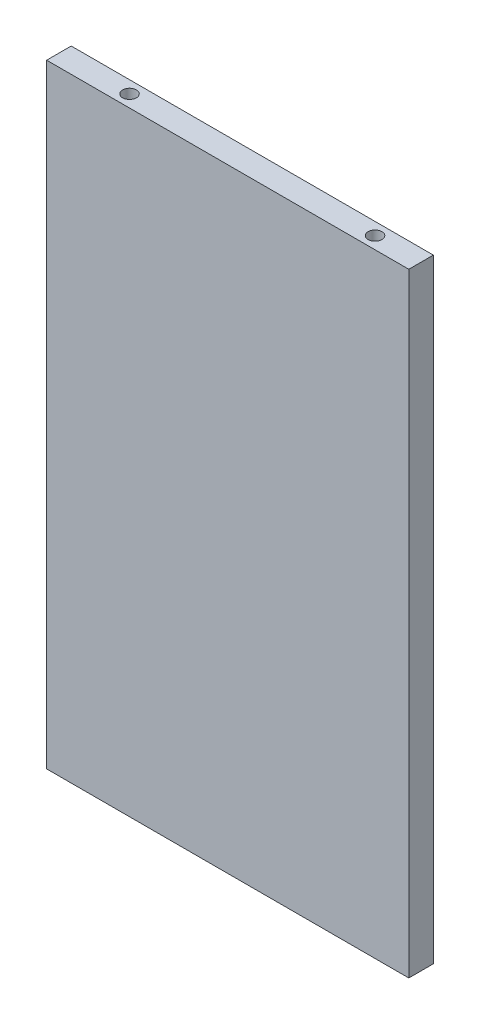
ISO-10303-21;
HEADER;
FILE_DESCRIPTION(('STEP AP214'),'2;1');
FILE_NAME('part.step','',(''),(''),'','','');
FILE_SCHEMA(('AUTOMOTIVE_DESIGN { 1 0 10303 214 1 1 1 1 }'));
ENDSEC;
DATA;
#1=APPLICATION_CONTEXT('core data for automotive mechanical design processes');
#2=APPLICATION_PROTOCOL_DEFINITION('international standard','automotive_design',2000,#1);
#3=PRODUCT_CONTEXT('',#1,'mechanical');
#4=PRODUCT('Part','Part','',(#3));
#5=PRODUCT_RELATED_PRODUCT_CATEGORY('part','',(#4));
#6=PRODUCT_DEFINITION_FORMATION('','',#4);
#7=PRODUCT_DEFINITION_CONTEXT('part definition',#1,'design');
#8=PRODUCT_DEFINITION('design','',#6,#7);
#9=PRODUCT_DEFINITION_SHAPE('','',#8);
#10=(LENGTH_UNIT() NAMED_UNIT(*) SI_UNIT(.MILLI.,.METRE.));
#11=(NAMED_UNIT(*) PLANE_ANGLE_UNIT() SI_UNIT($,.RADIAN.));
#12=(NAMED_UNIT(*) SI_UNIT($,.STERADIAN.) SOLID_ANGLE_UNIT());
#13=UNCERTAINTY_MEASURE_WITH_UNIT(LENGTH_MEASURE(1.E-05),#10,'distance_accuracy_value','');
#14=(GEOMETRIC_REPRESENTATION_CONTEXT(3) GLOBAL_UNCERTAINTY_ASSIGNED_CONTEXT((#13)) GLOBAL_UNIT_ASSIGNED_CONTEXT((#10,
#11,#12)) REPRESENTATION_CONTEXT('',''));
#15=CARTESIAN_POINT('',(0.,0.,0.));
#16=DIRECTION('',(0.,0.,1.));
#17=DIRECTION('',(1.,0.,0.));
#18=AXIS2_PLACEMENT_3D('',#15,#16,#17);
#19=CARTESIAN_POINT('',(0.,200.,0.));
#20=DIRECTION('',(1.,0.,0.));
#21=DIRECTION('',(0.,0.,-1.));
#22=AXIS2_PLACEMENT_3D('',#19,#20,#21);
#23=PLANE('',#22);
#24=DIRECTION('',(0.,0.,1.));
#25=VECTOR('',#24,1.);
#26=CARTESIAN_POINT('',(0.,0.,0.));
#27=LINE('',#26,#25);
#28=CARTESIAN_POINT('',(0.,0.,-8.));
#29=VERTEX_POINT('',#28);
#30=CARTESIAN_POINT('',(0.,0.,0.));
#31=VERTEX_POINT('',#30);
#32=EDGE_CURVE('E123',#29,#31,#27,.T.);
#33=ORIENTED_EDGE('',*,*,#32,.T.);
#34=DIRECTION('',(0.,-1.,0.));
#35=VECTOR('',#34,1.);
#36=CARTESIAN_POINT('',(0.,200.,0.));
#37=LINE('',#36,#35);
#38=CARTESIAN_POINT('',(0.,200.,0.));
#39=VERTEX_POINT('',#38);
#40=EDGE_CURVE('E11',#39,#31,#37,.T.);
#41=ORIENTED_EDGE('',*,*,#40,.F.);
#42=DIRECTION('',(0.,0.,1.));
#43=VECTOR('',#42,1.);
#44=CARTESIAN_POINT('',(0.,200.,0.));
#45=LINE('',#44,#43);
#46=CARTESIAN_POINT('',(0.,200.,-8.));
#47=VERTEX_POINT('',#46);
#48=EDGE_CURVE('E124',#47,#39,#45,.T.);
#49=ORIENTED_EDGE('',*,*,#48,.F.);
#50=DIRECTION('',(0.,-1.,0.));
#51=VECTOR('',#50,1.);
#52=CARTESIAN_POINT('',(0.,200.,-8.));
#53=LINE('',#52,#51);
#54=EDGE_CURVE('E130',#47,#29,#53,.T.);
#55=ORIENTED_EDGE('',*,*,#54,.T.);
#56=EDGE_LOOP('',(#33,#41,#49,#55));
#57=FACE_BOUND('',#56,.T.);
#58=ADVANCED_FACE('F31',(#57),#23,.F.);
#59=CARTESIAN_POINT('',(0.,200.,0.));
#60=DIRECTION('',(0.,0.,-1.));
#61=DIRECTION('',(-1.,0.,0.));
#62=AXIS2_PLACEMENT_3D('',#59,#60,#61);
#63=PLANE('',#62);
#64=DIRECTION('',(1.,0.,0.));
#65=VECTOR('',#64,1.);
#66=CARTESIAN_POINT('',(0.,0.,0.));
#67=LINE('',#66,#65);
#68=CARTESIAN_POINT('',(118.,0.,0.));
#69=VERTEX_POINT('',#68);
#70=EDGE_CURVE('E133',#31,#69,#67,.T.);
#71=ORIENTED_EDGE('',*,*,#70,.T.);
#72=DIRECTION('',(0.,-1.,0.));
#73=VECTOR('',#72,1.);
#74=CARTESIAN_POINT('',(118.,200.,0.));
#75=LINE('',#74,#73);
#76=CARTESIAN_POINT('',(118.,200.,0.));
#77=VERTEX_POINT('',#76);
#78=EDGE_CURVE('E39',#77,#69,#75,.T.);
#79=ORIENTED_EDGE('',*,*,#78,.F.);
#80=DIRECTION('',(1.,0.,0.));
#81=VECTOR('',#80,1.);
#82=CARTESIAN_POINT('',(0.,200.,0.));
#83=LINE('',#82,#81);
#84=EDGE_CURVE('E78',#39,#77,#83,.T.);
#85=ORIENTED_EDGE('',*,*,#84,.F.);
#86=ORIENTED_EDGE('',*,*,#40,.T.);
#87=EDGE_LOOP('',(#71,#79,#85,#86));
#88=FACE_BOUND('',#87,.T.);
#89=ADVANCED_FACE('F157',(#88),#63,.F.);
#90=CARTESIAN_POINT('',(118.,200.,0.));
#91=DIRECTION('',(-1.,0.,0.));
#92=DIRECTION('',(0.,0.,1.));
#93=AXIS2_PLACEMENT_3D('',#90,#91,#92);
#94=PLANE('',#93);
#95=DIRECTION('',(0.,0.,-1.));
#96=VECTOR('',#95,1.);
#97=CARTESIAN_POINT('',(118.,0.,0.));
#98=LINE('',#97,#96);
#99=CARTESIAN_POINT('',(118.,0.,-8.));
#100=VERTEX_POINT('',#99);
#101=EDGE_CURVE('E65',#69,#100,#98,.T.);
#102=ORIENTED_EDGE('',*,*,#101,.T.);
#103=DIRECTION('',(0.,-1.,0.));
#104=VECTOR('',#103,1.);
#105=CARTESIAN_POINT('',(118.,200.,-8.));
#106=LINE('',#105,#104);
#107=CARTESIAN_POINT('',(118.,200.,-8.));
#108=VERTEX_POINT('',#107);
#109=EDGE_CURVE('E138',#108,#100,#106,.T.);
#110=ORIENTED_EDGE('',*,*,#109,.F.);
#111=DIRECTION('',(0.,0.,-1.));
#112=VECTOR('',#111,1.);
#113=CARTESIAN_POINT('',(118.,200.,0.));
#114=LINE('',#113,#112);
#115=EDGE_CURVE('E127',#77,#108,#114,.T.);
#116=ORIENTED_EDGE('',*,*,#115,.F.);
#117=ORIENTED_EDGE('',*,*,#78,.T.);
#118=EDGE_LOOP('',(#102,#110,#116,#117));
#119=FACE_BOUND('',#118,.T.);
#120=ADVANCED_FACE('F140',(#119),#94,.F.);
#121=CARTESIAN_POINT('',(0.,200.,-8.));
#122=DIRECTION('',(0.,0.,1.));
#123=DIRECTION('',(1.,0.,0.));
#124=AXIS2_PLACEMENT_3D('',#121,#122,#123);
#125=PLANE('',#124);
#126=DIRECTION('',(-1.,0.,0.));
#127=VECTOR('',#126,1.);
#128=CARTESIAN_POINT('',(0.,0.,-8.));
#129=LINE('',#128,#127);
#130=EDGE_CURVE('E71',#100,#29,#129,.T.);
#131=ORIENTED_EDGE('',*,*,#130,.T.);
#132=ORIENTED_EDGE('',*,*,#54,.F.);
#133=DIRECTION('',(-1.,0.,0.));
#134=VECTOR('',#133,1.);
#135=CARTESIAN_POINT('',(0.,200.,-8.));
#136=LINE('',#135,#134);
#137=EDGE_CURVE('E47',#108,#47,#136,.T.);
#138=ORIENTED_EDGE('',*,*,#137,.F.);
#139=ORIENTED_EDGE('',*,*,#109,.T.);
#140=EDGE_LOOP('',(#131,#132,#138,#139));
#141=FACE_BOUND('',#140,.T.);
#142=ADVANCED_FACE('F147',(#141),#125,.F.);
#143=CARTESIAN_POINT('',(0.,200.,-8.));
#144=DIRECTION('',(0.,-1.,0.));
#145=DIRECTION('',(0.,0.,-1.));
#146=AXIS2_PLACEMENT_3D('',#143,#144,#145);
#147=PLANE('',#146);
#148=CARTESIAN_POINT('',(23.,200.,-3.99999999999999));
#149=DIRECTION('',(0.,1.,0.));
#150=DIRECTION('',(0.,0.,1.));
#151=AXIS2_PLACEMENT_3D('',#148,#149,#150);
#152=CIRCLE('',#151,2.25);
#153=CARTESIAN_POINT('',(23.,200.,-1.74999999999999));
#154=VERTEX_POINT('',#153);
#155=EDGE_CURVE('E114',#154,#154,#152,.T.);
#156=ORIENTED_EDGE('',*,*,#155,.F.);
#157=EDGE_LOOP('',(#156));
#158=FACE_BOUND('',#157,.T.);
#159=CARTESIAN_POINT('',(103.,200.,-4.));
#160=DIRECTION('',(0.,1.,0.));
#161=DIRECTION('',(0.,0.,1.));
#162=AXIS2_PLACEMENT_3D('',#159,#160,#161);
#163=CIRCLE('',#162,2.25);
#164=CARTESIAN_POINT('',(103.,200.,-1.75));
#165=VERTEX_POINT('',#164);
#166=EDGE_CURVE('E120',#165,#165,#163,.T.);
#167=ORIENTED_EDGE('',*,*,#166,.F.);
#168=EDGE_LOOP('',(#167));
#169=FACE_BOUND('',#168,.T.);
#170=ORIENTED_EDGE('',*,*,#48,.T.);
#171=ORIENTED_EDGE('',*,*,#84,.T.);
#172=ORIENTED_EDGE('',*,*,#115,.T.);
#173=ORIENTED_EDGE('',*,*,#137,.T.);
#174=EDGE_LOOP('',(#170,#171,#172,#173));
#175=FACE_BOUND('',#174,.T.);
#176=ADVANCED_FACE('F149',(#158,#169,#175),#147,.F.);
#177=CARTESIAN_POINT('',(0.,0.,-8.));
#178=DIRECTION('',(0.,-1.,0.));
#179=DIRECTION('',(0.,0.,-1.));
#180=AXIS2_PLACEMENT_3D('',#177,#178,#179);
#181=PLANE('',#180);
#182=CARTESIAN_POINT('',(23.,0.,-4.));
#183=DIRECTION('',(0.,-1.,0.));
#184=DIRECTION('',(0.,0.,-1.));
#185=AXIS2_PLACEMENT_3D('',#182,#183,#184);
#186=CIRCLE('',#185,2.24999999999999);
#187=CARTESIAN_POINT('',(23.,0.,-6.24999999999999));
#188=VERTEX_POINT('',#187);
#189=EDGE_CURVE('E100',#188,#188,#186,.T.);
#190=ORIENTED_EDGE('',*,*,#189,.F.);
#191=EDGE_LOOP('',(#190));
#192=FACE_BOUND('',#191,.T.);
#193=CARTESIAN_POINT('',(103.,0.,-4.));
#194=DIRECTION('',(0.,-1.,0.));
#195=DIRECTION('',(0.,0.,-1.));
#196=AXIS2_PLACEMENT_3D('',#193,#194,#195);
#197=CIRCLE('',#196,2.24999999999999);
#198=CARTESIAN_POINT('',(103.,0.,-6.24999999999999));
#199=VERTEX_POINT('',#198);
#200=EDGE_CURVE('E108',#199,#199,#197,.T.);
#201=ORIENTED_EDGE('',*,*,#200,.F.);
#202=EDGE_LOOP('',(#201));
#203=FACE_BOUND('',#202,.T.);
#204=ORIENTED_EDGE('',*,*,#32,.F.);
#205=ORIENTED_EDGE('',*,*,#130,.F.);
#206=ORIENTED_EDGE('',*,*,#101,.F.);
#207=ORIENTED_EDGE('',*,*,#70,.F.);
#208=EDGE_LOOP('',(#204,#205,#206,#207));
#209=FACE_BOUND('',#208,.T.);
#210=ADVANCED_FACE('F143',(#192,#203,#209),#181,.T.);
#211=CARTESIAN_POINT('',(103.,200.,-4.));
#212=DIRECTION('',(0.,1.,0.));
#213=DIRECTION('',(0.,0.,1.));
#214=AXIS2_PLACEMENT_3D('',#211,#212,#213);
#215=CYLINDRICAL_SURFACE('',#214,2.25);
#216=CARTESIAN_POINT('',(103.,180.,-4.));
#217=DIRECTION('',(0.,1.,0.));
#218=DIRECTION('',(0.,0.,1.));
#219=AXIS2_PLACEMENT_3D('',#216,#217,#218);
#220=CIRCLE('',#219,2.25);
#221=CARTESIAN_POINT('',(103.,180.,-1.75));
#222=VERTEX_POINT('',#221);
#223=EDGE_CURVE('E117',#222,#222,#220,.T.);
#224=ORIENTED_EDGE('',*,*,#223,.F.);
#225=EDGE_LOOP('',(#224));
#226=FACE_BOUND('',#225,.T.);
#227=ORIENTED_EDGE('',*,*,#166,.T.);
#228=EDGE_LOOP('',(#227));
#229=FACE_BOUND('',#228,.T.);
#230=ADVANCED_FACE('F187',(#226,#229),#215,.F.);
#231=CARTESIAN_POINT('',(103.,180.,-4.));
#232=DIRECTION('',(0.,1.,0.));
#233=DIRECTION('',(0.,0.,1.));
#234=AXIS2_PLACEMENT_3D('',#231,#232,#233);
#235=CONICAL_SURFACE('',#234,2.25,1.02974425867665);
#236=CARTESIAN_POINT('',(103.,178.648063607188,-4.));
#237=VERTEX_POINT('',#236);
#238=VERTEX_LOOP('',#237);
#239=FACE_BOUND('',#238,.T.);
#240=ORIENTED_EDGE('',*,*,#223,.T.);
#241=EDGE_LOOP('',(#240));
#242=FACE_BOUND('',#241,.T.);
#243=ADVANCED_FACE('F192',(#239,#242),#235,.F.);
#244=CARTESIAN_POINT('',(23.,200.,-3.99999999999999));
#245=DIRECTION('',(0.,1.,0.));
#246=DIRECTION('',(0.,0.,1.));
#247=AXIS2_PLACEMENT_3D('',#244,#245,#246);
#248=CYLINDRICAL_SURFACE('',#247,2.25);
#249=CARTESIAN_POINT('',(23.,180.,-3.99999999999999));
#250=DIRECTION('',(0.,1.,0.));
#251=DIRECTION('',(0.,0.,1.));
#252=AXIS2_PLACEMENT_3D('',#249,#250,#251);
#253=CIRCLE('',#252,2.25);
#254=CARTESIAN_POINT('',(23.,180.,-1.74999999999999));
#255=VERTEX_POINT('',#254);
#256=EDGE_CURVE('E111',#255,#255,#253,.T.);
#257=ORIENTED_EDGE('',*,*,#256,.F.);
#258=EDGE_LOOP('',(#257));
#259=FACE_BOUND('',#258,.T.);
#260=ORIENTED_EDGE('',*,*,#155,.T.);
#261=EDGE_LOOP('',(#260));
#262=FACE_BOUND('',#261,.T.);
#263=ADVANCED_FACE('F202',(#259,#262),#248,.F.);
#264=CARTESIAN_POINT('',(23.,180.,-3.99999999999999));
#265=DIRECTION('',(0.,1.,0.));
#266=DIRECTION('',(0.,0.,1.));
#267=AXIS2_PLACEMENT_3D('',#264,#265,#266);
#268=CONICAL_SURFACE('',#267,2.25,1.02974425867665);
#269=CARTESIAN_POINT('',(23.,178.648063607188,-3.99999999999999));
#270=VERTEX_POINT('',#269);
#271=VERTEX_LOOP('',#270);
#272=FACE_BOUND('',#271,.T.);
#273=ORIENTED_EDGE('',*,*,#256,.T.);
#274=EDGE_LOOP('',(#273));
#275=FACE_BOUND('',#274,.T.);
#276=ADVANCED_FACE('F212',(#272,#275),#268,.F.);
#277=CARTESIAN_POINT('',(103.,0.,-4.));
#278=DIRECTION('',(0.,-1.,0.));
#279=DIRECTION('',(0.,0.,-1.));
#280=AXIS2_PLACEMENT_3D('',#277,#278,#279);
#281=CYLINDRICAL_SURFACE('',#280,2.24999999999999);
#282=CARTESIAN_POINT('',(103.,20.,-4.));
#283=DIRECTION('',(0.,-1.,0.));
#284=DIRECTION('',(0.,0.,-1.));
#285=AXIS2_PLACEMENT_3D('',#282,#283,#284);
#286=CIRCLE('',#285,2.24999999999999);
#287=CARTESIAN_POINT('',(103.,20.,-6.24999999999999));
#288=VERTEX_POINT('',#287);
#289=EDGE_CURVE('E103',#288,#288,#286,.T.);
#290=ORIENTED_EDGE('',*,*,#289,.F.);
#291=EDGE_LOOP('',(#290));
#292=FACE_BOUND('',#291,.T.);
#293=ORIENTED_EDGE('',*,*,#200,.T.);
#294=EDGE_LOOP('',(#293));
#295=FACE_BOUND('',#294,.T.);
#296=ADVANCED_FACE('F222',(#292,#295),#281,.F.);
#297=CARTESIAN_POINT('',(103.,20.,-4.));
#298=DIRECTION('',(0.,-1.,0.));
#299=DIRECTION('',(0.,0.,-1.));
#300=AXIS2_PLACEMENT_3D('',#297,#298,#299);
#301=CONICAL_SURFACE('',#300,2.24999999999999,1.02974425867665);
#302=CARTESIAN_POINT('',(103.,21.351936392812,-4.));
#303=VERTEX_POINT('',#302);
#304=VERTEX_LOOP('',#303);
#305=FACE_BOUND('',#304,.T.);
#306=ORIENTED_EDGE('',*,*,#289,.T.);
#307=EDGE_LOOP('',(#306));
#308=FACE_BOUND('',#307,.T.);
#309=ADVANCED_FACE('F238',(#305,#308),#301,.F.);
#310=CARTESIAN_POINT('',(23.,0.,-4.));
#311=DIRECTION('',(0.,-1.,0.));
#312=DIRECTION('',(0.,0.,-1.));
#313=AXIS2_PLACEMENT_3D('',#310,#311,#312);
#314=CYLINDRICAL_SURFACE('',#313,2.24999999999999);
#315=CARTESIAN_POINT('',(23.,20.,-4.));
#316=DIRECTION('',(0.,-1.,0.));
#317=DIRECTION('',(0.,0.,-1.));
#318=AXIS2_PLACEMENT_3D('',#315,#316,#317);
#319=CIRCLE('',#318,2.24999999999999);
#320=CARTESIAN_POINT('',(23.,20.,-6.24999999999999));
#321=VERTEX_POINT('',#320);
#322=EDGE_CURVE('E98',#321,#321,#319,.T.);
#323=ORIENTED_EDGE('',*,*,#322,.F.);
#324=EDGE_LOOP('',(#323));
#325=FACE_BOUND('',#324,.T.);
#326=ORIENTED_EDGE('',*,*,#189,.T.);
#327=EDGE_LOOP('',(#326));
#328=FACE_BOUND('',#327,.T.);
#329=ADVANCED_FACE('F94',(#325,#328),#314,.F.);
#330=CARTESIAN_POINT('',(23.,20.,-4.));
#331=DIRECTION('',(0.,-1.,0.));
#332=DIRECTION('',(0.,0.,-1.));
#333=AXIS2_PLACEMENT_3D('',#330,#331,#332);
#334=CONICAL_SURFACE('',#333,2.24999999999999,1.02974425867665);
#335=CARTESIAN_POINT('',(23.,21.351936392812,-4.));
#336=VERTEX_POINT('',#335);
#337=VERTEX_LOOP('',#336);
#338=FACE_BOUND('',#337,.T.);
#339=ORIENTED_EDGE('',*,*,#322,.T.);
#340=EDGE_LOOP('',(#339));
#341=FACE_BOUND('',#340,.T.);
#342=ADVANCED_FACE('F91',(#338,#341),#334,.F.);
#343=CLOSED_SHELL('',(#58,#89,#120,#142,#176,#210,#230,#243,#263,#276,#296,#309,#329,#342));
#344=MANIFOLD_SOLID_BREP('B2',#343);
#345=ADVANCED_BREP_SHAPE_REPRESENTATION('',(#18,#344),#14);
#346=SHAPE_DEFINITION_REPRESENTATION(#9,#345);
ENDSEC;
END-ISO-10303-21;
